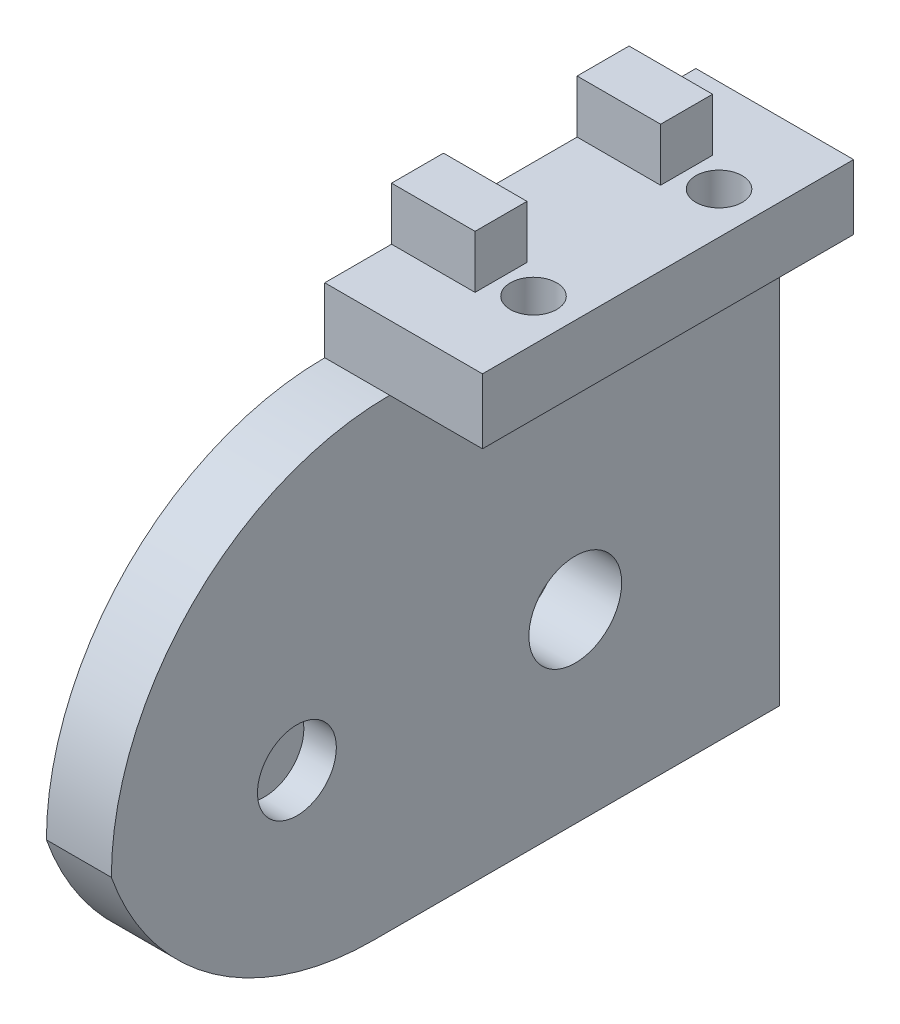
ISO-10303-21;
HEADER;
FILE_DESCRIPTION(('STEP AP214'),'2;1');
FILE_NAME('part.step','',(''),(''),'','','');
FILE_SCHEMA(('AUTOMOTIVE_DESIGN { 1 0 10303 214 1 1 1 1 }'));
ENDSEC;
DATA;
#1=APPLICATION_CONTEXT('core data for automotive mechanical design processes');
#2=APPLICATION_PROTOCOL_DEFINITION('international standard','automotive_design',2000,#1);
#3=PRODUCT_CONTEXT('',#1,'mechanical');
#4=PRODUCT('Part','Part','',(#3));
#5=PRODUCT_RELATED_PRODUCT_CATEGORY('part','',(#4));
#6=PRODUCT_DEFINITION_FORMATION('','',#4);
#7=PRODUCT_DEFINITION_CONTEXT('part definition',#1,'design');
#8=PRODUCT_DEFINITION('design','',#6,#7);
#9=PRODUCT_DEFINITION_SHAPE('','',#8);
#10=(LENGTH_UNIT() NAMED_UNIT(*) SI_UNIT(.MILLI.,.METRE.));
#11=(NAMED_UNIT(*) PLANE_ANGLE_UNIT() SI_UNIT($,.RADIAN.));
#12=(NAMED_UNIT(*) SI_UNIT($,.STERADIAN.) SOLID_ANGLE_UNIT());
#13=UNCERTAINTY_MEASURE_WITH_UNIT(LENGTH_MEASURE(1.E-05),#10,'distance_accuracy_value','');
#14=(GEOMETRIC_REPRESENTATION_CONTEXT(3) GLOBAL_UNCERTAINTY_ASSIGNED_CONTEXT((#13)) GLOBAL_UNIT_ASSIGNED_CONTEXT((#10,
#11,#12)) REPRESENTATION_CONTEXT('',''));
#15=CARTESIAN_POINT('',(0.,0.,0.));
#16=DIRECTION('',(0.,0.,1.));
#17=DIRECTION('',(1.,0.,0.));
#18=AXIS2_PLACEMENT_3D('',#15,#16,#17);
#19=CARTESIAN_POINT('',(20.,7.,20.));
#20=DIRECTION('',(0.,0.,-1.));
#21=DIRECTION('',(-1.,0.,0.));
#22=AXIS2_PLACEMENT_3D('',#19,#20,#21);
#23=PLANE('',#22);
#24=DIRECTION('',(1.,0.,0.));
#25=VECTOR('',#24,1.);
#26=CARTESIAN_POINT('',(20.,7.,20.));
#27=LINE('',#26,#25);
#28=CARTESIAN_POINT('',(3.,7.,20.));
#29=VERTEX_POINT('',#28);
#30=CARTESIAN_POINT('',(20.,7.,20.));
#31=VERTEX_POINT('',#30);
#32=EDGE_CURVE('E157',#29,#31,#27,.T.);
#33=ORIENTED_EDGE('',*,*,#32,.F.);
#34=DIRECTION('',(0.,-1.,0.));
#35=VECTOR('',#34,1.);
#36=CARTESIAN_POINT('',(3.,7.,20.));
#37=LINE('',#36,#35);
#38=CARTESIAN_POINT('',(3.,0.,20.));
#39=VERTEX_POINT('',#38);
#40=EDGE_CURVE('E151',#29,#39,#37,.T.);
#41=ORIENTED_EDGE('',*,*,#40,.T.);
#42=DIRECTION('',(1.,0.,0.));
#43=VECTOR('',#42,1.);
#44=CARTESIAN_POINT('',(20.,0.,20.));
#45=LINE('',#44,#43);
#46=CARTESIAN_POINT('',(10.,0.,20.));
#47=VERTEX_POINT('',#46);
#48=EDGE_CURVE('E154',#39,#47,#45,.T.);
#49=ORIENTED_EDGE('',*,*,#48,.T.);
#50=CARTESIAN_POINT('',(20.,0.,20.));
#51=VERTEX_POINT('',#50);
#52=EDGE_CURVE('E173',#47,#51,#45,.T.);
#53=ORIENTED_EDGE('',*,*,#52,.T.);
#54=DIRECTION('',(0.,-1.,0.));
#55=VECTOR('',#54,1.);
#56=CARTESIAN_POINT('',(20.,7.,20.));
#57=LINE('',#56,#55);
#58=EDGE_CURVE('E188',#31,#51,#57,.T.);
#59=ORIENTED_EDGE('',*,*,#58,.F.);
#60=EDGE_LOOP('',(#33,#41,#49,#53,#59));
#61=FACE_BOUND('',#60,.T.);
#62=ADVANCED_FACE('F34',(#61),#23,.F.);
#63=CARTESIAN_POINT('',(20.,7.,-20.));
#64=DIRECTION('',(-1.,0.,0.));
#65=DIRECTION('',(0.,0.,1.));
#66=AXIS2_PLACEMENT_3D('',#63,#64,#65);
#67=PLANE('',#66);
#68=DIRECTION('',(0.,-1.,0.));
#69=VECTOR('',#68,1.);
#70=CARTESIAN_POINT('',(20.,7.,-20.));
#71=LINE('',#70,#69);
#72=CARTESIAN_POINT('',(20.,7.,-20.));
#73=VERTEX_POINT('',#72);
#74=CARTESIAN_POINT('',(20.,0.,-20.));
#75=VERTEX_POINT('',#74);
#76=EDGE_CURVE('E185',#73,#75,#71,.T.);
#77=ORIENTED_EDGE('',*,*,#76,.F.);
#78=DIRECTION('',(0.,0.,-1.));
#79=VECTOR('',#78,1.);
#80=CARTESIAN_POINT('',(20.,7.,-20.));
#81=LINE('',#80,#79);
#82=EDGE_CURVE('E275',#31,#73,#81,.T.);
#83=ORIENTED_EDGE('',*,*,#82,.F.);
#84=ORIENTED_EDGE('',*,*,#58,.T.);
#85=DIRECTION('',(0.,0.,-1.));
#86=VECTOR('',#85,1.);
#87=CARTESIAN_POINT('',(20.,0.,-20.));
#88=LINE('',#87,#86);
#89=EDGE_CURVE('E172',#51,#75,#88,.T.);
#90=ORIENTED_EDGE('',*,*,#89,.T.);
#91=EDGE_LOOP('',(#77,#83,#84,#90));
#92=FACE_BOUND('',#91,.T.);
#93=ADVANCED_FACE('F338',(#92),#67,.F.);
#94=CARTESIAN_POINT('',(20.,7.,-20.));
#95=DIRECTION('',(0.,0.,1.));
#96=DIRECTION('',(1.,0.,0.));
#97=AXIS2_PLACEMENT_3D('',#94,#95,#96);
#98=PLANE('',#97);
#99=DIRECTION('',(-1.,0.,0.));
#100=VECTOR('',#99,1.);
#101=CARTESIAN_POINT('',(20.,0.,-20.));
#102=LINE('',#101,#100);
#103=CARTESIAN_POINT('',(10.,0.,-20.));
#104=VERTEX_POINT('',#103);
#105=CARTESIAN_POINT('',(3.,0.,-20.));
#106=VERTEX_POINT('',#105);
#107=EDGE_CURVE('E175',#104,#106,#102,.T.);
#108=ORIENTED_EDGE('',*,*,#107,.T.);
#109=DIRECTION('',(0.,1.,0.));
#110=VECTOR('',#109,1.);
#111=CARTESIAN_POINT('',(3.,7.,-20.));
#112=LINE('',#111,#110);
#113=CARTESIAN_POINT('',(3.,7.,-20.));
#114=VERTEX_POINT('',#113);
#115=EDGE_CURVE('E158',#106,#114,#112,.T.);
#116=ORIENTED_EDGE('',*,*,#115,.T.);
#117=DIRECTION('',(-1.,0.,0.));
#118=VECTOR('',#117,1.);
#119=CARTESIAN_POINT('',(20.,7.,-20.));
#120=LINE('',#119,#118);
#121=EDGE_CURVE('E179',#73,#114,#120,.T.);
#122=ORIENTED_EDGE('',*,*,#121,.F.);
#123=ORIENTED_EDGE('',*,*,#76,.T.);
#124=EDGE_CURVE('E182',#75,#104,#102,.T.);
#125=ORIENTED_EDGE('',*,*,#124,.T.);
#126=EDGE_LOOP('',(#108,#116,#122,#123,#125));
#127=FACE_BOUND('',#126,.T.);
#128=ADVANCED_FACE('F288',(#127),#98,.F.);
#129=CARTESIAN_POINT('',(0.,7.,0.));
#130=DIRECTION('',(0.,-1.,0.));
#131=DIRECTION('',(0.,0.,-1.));
#132=AXIS2_PLACEMENT_3D('',#129,#130,#131);
#133=PLANE('',#132);
#134=CARTESIAN_POINT('',(15.5,7.,10.));
#135=DIRECTION('',(0.,1.,0.));
#136=DIRECTION('',(0.,0.,1.));
#137=AXIS2_PLACEMENT_3D('',#134,#135,#136);
#138=CIRCLE('',#137,2.5);
#139=CARTESIAN_POINT('',(15.5,7.,12.5));
#140=VERTEX_POINT('',#139);
#141=EDGE_CURVE('E227',#140,#140,#138,.T.);
#142=ORIENTED_EDGE('',*,*,#141,.F.);
#143=EDGE_LOOP('',(#142));
#144=FACE_BOUND('',#143,.T.);
#145=CARTESIAN_POINT('',(15.5,7.,-10.));
#146=DIRECTION('',(0.,1.,0.));
#147=DIRECTION('',(0.,0.,1.));
#148=AXIS2_PLACEMENT_3D('',#145,#146,#147);
#149=CIRCLE('',#148,2.49999999999999);
#150=CARTESIAN_POINT('',(15.5,7.,-7.5));
#151=VERTEX_POINT('',#150);
#152=EDGE_CURVE('E228',#151,#151,#149,.T.);
#153=ORIENTED_EDGE('',*,*,#152,.F.);
#154=EDGE_LOOP('',(#153));
#155=FACE_BOUND('',#154,.T.);
#156=ORIENTED_EDGE('',*,*,#121,.T.);
#157=DIRECTION('',(0.,0.,1.));
#158=VECTOR('',#157,1.);
#159=CARTESIAN_POINT('',(3.,7.,0.));
#160=LINE('',#159,#158);
#161=CARTESIAN_POINT('',(3.,7.,-12.8));
#162=VERTEX_POINT('',#161);
#163=EDGE_CURVE('E284',#114,#162,#160,.T.);
#164=ORIENTED_EDGE('',*,*,#163,.T.);
#165=DIRECTION('',(-1.,0.,0.));
#166=VECTOR('',#165,1.);
#167=CARTESIAN_POINT('',(27.9906195003892,7.,-12.8));
#168=LINE('',#167,#166);
#169=CARTESIAN_POINT('',(12.,7.,-12.8));
#170=VERTEX_POINT('',#169);
#171=EDGE_CURVE('E267',#170,#162,#168,.T.);
#172=ORIENTED_EDGE('',*,*,#171,.F.);
#173=DIRECTION('',(0.,0.,1.));
#174=VECTOR('',#173,1.);
#175=CARTESIAN_POINT('',(12.,7.,-20.));
#176=LINE('',#175,#174);
#177=CARTESIAN_POINT('',(12.,7.,-7.20000000000001));
#178=VERTEX_POINT('',#177);
#179=EDGE_CURVE('E245',#170,#178,#176,.T.);
#180=ORIENTED_EDGE('',*,*,#179,.T.);
#181=DIRECTION('',(-1.,0.,0.));
#182=VECTOR('',#181,1.);
#183=CARTESIAN_POINT('',(27.9906195003892,7.,-7.20000000000001));
#184=LINE('',#183,#182);
#185=CARTESIAN_POINT('',(3.,7.,-7.20000000000001));
#186=VERTEX_POINT('',#185);
#187=EDGE_CURVE('E177',#178,#186,#184,.T.);
#188=ORIENTED_EDGE('',*,*,#187,.T.);
#189=CARTESIAN_POINT('',(3.,7.,7.2));
#190=VERTEX_POINT('',#189);
#191=EDGE_CURVE('E295',#186,#190,#160,.T.);
#192=ORIENTED_EDGE('',*,*,#191,.T.);
#193=DIRECTION('',(-1.,0.,0.));
#194=VECTOR('',#193,1.);
#195=CARTESIAN_POINT('',(27.9906195003892,7.,7.19999999999999));
#196=LINE('',#195,#194);
#197=CARTESIAN_POINT('',(12.,7.,7.19999999999999));
#198=VERTEX_POINT('',#197);
#199=EDGE_CURVE('E252',#198,#190,#196,.T.);
#200=ORIENTED_EDGE('',*,*,#199,.F.);
#201=CARTESIAN_POINT('',(12.,7.,12.8));
#202=VERTEX_POINT('',#201);
#203=EDGE_CURVE('E242',#198,#202,#176,.T.);
#204=ORIENTED_EDGE('',*,*,#203,.T.);
#205=DIRECTION('',(-1.,0.,0.));
#206=VECTOR('',#205,1.);
#207=CARTESIAN_POINT('',(27.9906195003892,7.,12.8));
#208=LINE('',#207,#206);
#209=CARTESIAN_POINT('',(3.,7.,12.8));
#210=VERTEX_POINT('',#209);
#211=EDGE_CURVE('E260',#202,#210,#208,.T.);
#212=ORIENTED_EDGE('',*,*,#211,.T.);
#213=EDGE_CURVE('E49',#210,#29,#160,.T.);
#214=ORIENTED_EDGE('',*,*,#213,.T.);
#215=ORIENTED_EDGE('',*,*,#32,.T.);
#216=ORIENTED_EDGE('',*,*,#82,.T.);
#217=EDGE_LOOP('',(#156,#164,#172,#180,#188,#192,#200,#204,#212,#214,#215,#216));
#218=FACE_BOUND('',#217,.T.);
#219=ADVANCED_FACE('F282',(#144,#155,#218),#133,.F.);
#220=CARTESIAN_POINT('',(0.,0.,0.));
#221=DIRECTION('',(0.,-1.,0.));
#222=DIRECTION('',(0.,0.,-1.));
#223=AXIS2_PLACEMENT_3D('',#220,#221,#222);
#224=PLANE('',#223);
#225=DIRECTION('',(0.,0.,1.));
#226=VECTOR('',#225,1.);
#227=CARTESIAN_POINT('',(9.99999999999999,0.,50.));
#228=LINE('',#227,#226);
#229=EDGE_CURVE('E193',#104,#47,#228,.T.);
#230=ORIENTED_EDGE('',*,*,#229,.F.);
#231=ORIENTED_EDGE('',*,*,#124,.F.);
#232=ORIENTED_EDGE('',*,*,#89,.F.);
#233=ORIENTED_EDGE('',*,*,#52,.F.);
#234=EDGE_LOOP('',(#230,#231,#232,#233));
#235=FACE_BOUND('',#234,.T.);
#236=CARTESIAN_POINT('',(15.5,0.,10.));
#237=DIRECTION('',(0.,-1.,0.));
#238=DIRECTION('',(0.,0.,-1.));
#239=AXIS2_PLACEMENT_3D('',#236,#237,#238);
#240=CIRCLE('',#239,2.5);
#241=CARTESIAN_POINT('',(15.5,0.,7.50000000000001));
#242=VERTEX_POINT('',#241);
#243=EDGE_CURVE('E232',#242,#242,#240,.F.);
#244=ORIENTED_EDGE('',*,*,#243,.T.);
#245=EDGE_LOOP('',(#244));
#246=FACE_BOUND('',#245,.T.);
#247=CARTESIAN_POINT('',(15.5,0.,-10.));
#248=DIRECTION('',(0.,-1.,0.));
#249=DIRECTION('',(0.,0.,-1.));
#250=AXIS2_PLACEMENT_3D('',#247,#248,#249);
#251=CIRCLE('',#250,2.49999999999999);
#252=CARTESIAN_POINT('',(15.5,0.,-12.5));
#253=VERTEX_POINT('',#252);
#254=EDGE_CURVE('E231',#253,#253,#251,.F.);
#255=ORIENTED_EDGE('',*,*,#254,.T.);
#256=EDGE_LOOP('',(#255));
#257=FACE_BOUND('',#256,.T.);
#258=ADVANCED_FACE('F374',(#235,#246,#257),#224,.T.);
#259=CARTESIAN_POINT('',(27.9906195003892,7.,-7.20000000000001));
#260=DIRECTION('',(0.,0.,1.));
#261=DIRECTION('',(1.,0.,0.));
#262=AXIS2_PLACEMENT_3D('',#259,#260,#261);
#263=PLANE('',#262);
#264=DIRECTION('',(0.,1.,0.));
#265=VECTOR('',#264,1.);
#266=CARTESIAN_POINT('',(3.,7.,-7.20000000000001));
#267=LINE('',#266,#265);
#268=CARTESIAN_POINT('',(3.,12.7,-7.2));
#269=VERTEX_POINT('',#268);
#270=EDGE_CURVE('E306',#186,#269,#267,.T.);
#271=ORIENTED_EDGE('',*,*,#270,.F.);
#272=ORIENTED_EDGE('',*,*,#187,.F.);
#273=DIRECTION('',(0.,-1.,0.));
#274=VECTOR('',#273,1.);
#275=CARTESIAN_POINT('',(12.,7.,-7.20000000000001));
#276=LINE('',#275,#274);
#277=CARTESIAN_POINT('',(12.,12.7,-7.2));
#278=VERTEX_POINT('',#277);
#279=EDGE_CURVE('E250',#278,#178,#276,.T.);
#280=ORIENTED_EDGE('',*,*,#279,.F.);
#281=DIRECTION('',(-1.,0.,0.));
#282=VECTOR('',#281,1.);
#283=CARTESIAN_POINT('',(27.9906195003892,12.7,-7.20000000000001));
#284=LINE('',#283,#282);
#285=EDGE_CURVE('E256',#278,#269,#284,.T.);
#286=ORIENTED_EDGE('',*,*,#285,.T.);
#287=EDGE_LOOP('',(#271,#272,#280,#286));
#288=FACE_BOUND('',#287,.T.);
#289=ADVANCED_FACE('F380',(#288),#263,.T.);
#290=CARTESIAN_POINT('',(27.9906195003892,7.,-12.8));
#291=DIRECTION('',(0.,0.,-1.));
#292=DIRECTION('',(0.,1.,0.));
#293=AXIS2_PLACEMENT_3D('',#290,#291,#292);
#294=PLANE('',#293);
#295=DIRECTION('',(0.,-1.,0.));
#296=VECTOR('',#295,1.);
#297=CARTESIAN_POINT('',(3.,7.,-12.8));
#298=LINE('',#297,#296);
#299=CARTESIAN_POINT('',(3.,12.7,-12.8));
#300=VERTEX_POINT('',#299);
#301=EDGE_CURVE('E302',#300,#162,#298,.T.);
#302=ORIENTED_EDGE('',*,*,#301,.F.);
#303=DIRECTION('',(-1.,0.,0.));
#304=VECTOR('',#303,1.);
#305=CARTESIAN_POINT('',(27.9906195003892,12.7,-12.8));
#306=LINE('',#305,#304);
#307=CARTESIAN_POINT('',(12.,12.7,-12.8));
#308=VERTEX_POINT('',#307);
#309=EDGE_CURVE('E270',#308,#300,#306,.T.);
#310=ORIENTED_EDGE('',*,*,#309,.F.);
#311=DIRECTION('',(0.,1.,0.));
#312=VECTOR('',#311,1.);
#313=CARTESIAN_POINT('',(12.,7.,-12.8));
#314=LINE('',#313,#312);
#315=EDGE_CURVE('E248',#170,#308,#314,.T.);
#316=ORIENTED_EDGE('',*,*,#315,.F.);
#317=ORIENTED_EDGE('',*,*,#171,.T.);
#318=EDGE_LOOP('',(#302,#310,#316,#317));
#319=FACE_BOUND('',#318,.T.);
#320=ADVANCED_FACE('F415',(#319),#294,.T.);
#321=CARTESIAN_POINT('',(27.9906195003892,12.7,-7.20000000000001));
#322=DIRECTION('',(0.,1.,0.));
#323=DIRECTION('',(0.,0.,1.));
#324=AXIS2_PLACEMENT_3D('',#321,#322,#323);
#325=PLANE('',#324);
#326=DIRECTION('',(0.,0.,-1.));
#327=VECTOR('',#326,1.);
#328=CARTESIAN_POINT('',(3.,12.7,-7.20000000000001));
#329=LINE('',#328,#327);
#330=EDGE_CURVE('E304',#269,#300,#329,.T.);
#331=ORIENTED_EDGE('',*,*,#330,.F.);
#332=ORIENTED_EDGE('',*,*,#285,.F.);
#333=DIRECTION('',(0.,0.,1.));
#334=VECTOR('',#333,1.);
#335=CARTESIAN_POINT('',(12.,12.7,-20.));
#336=LINE('',#335,#334);
#337=EDGE_CURVE('E241',#308,#278,#336,.T.);
#338=ORIENTED_EDGE('',*,*,#337,.F.);
#339=ORIENTED_EDGE('',*,*,#309,.T.);
#340=EDGE_LOOP('',(#331,#332,#338,#339));
#341=FACE_BOUND('',#340,.T.);
#342=ADVANCED_FACE('F413',(#341),#325,.T.);
#343=CARTESIAN_POINT('',(27.9906195003892,7.,7.19999999999999));
#344=DIRECTION('',(0.,0.,-1.));
#345=DIRECTION('',(-1.,0.,0.));
#346=AXIS2_PLACEMENT_3D('',#343,#344,#345);
#347=PLANE('',#346);
#348=DIRECTION('',(0.,-1.,0.));
#349=VECTOR('',#348,1.);
#350=CARTESIAN_POINT('',(3.,7.,7.2));
#351=LINE('',#350,#349);
#352=CARTESIAN_POINT('',(3.,12.7,7.19999999999999));
#353=VERTEX_POINT('',#352);
#354=EDGE_CURVE('E300',#353,#190,#351,.T.);
#355=ORIENTED_EDGE('',*,*,#354,.F.);
#356=DIRECTION('',(-1.,0.,0.));
#357=VECTOR('',#356,1.);
#358=CARTESIAN_POINT('',(27.9906195003892,12.7,7.19999999999999));
#359=LINE('',#358,#357);
#360=CARTESIAN_POINT('',(12.,12.7,7.19999999999999));
#361=VERTEX_POINT('',#360);
#362=EDGE_CURVE('E253',#361,#353,#359,.T.);
#363=ORIENTED_EDGE('',*,*,#362,.F.);
#364=DIRECTION('',(0.,1.,0.));
#365=VECTOR('',#364,1.);
#366=CARTESIAN_POINT('',(12.,7.,7.2));
#367=LINE('',#366,#365);
#368=EDGE_CURVE('E246',#198,#361,#367,.T.);
#369=ORIENTED_EDGE('',*,*,#368,.F.);
#370=ORIENTED_EDGE('',*,*,#199,.T.);
#371=EDGE_LOOP('',(#355,#363,#369,#370));
#372=FACE_BOUND('',#371,.T.);
#373=ADVANCED_FACE('F406',(#372),#347,.T.);
#374=CARTESIAN_POINT('',(27.9906195003892,12.7,7.19999999999999));
#375=DIRECTION('',(0.,1.,0.));
#376=DIRECTION('',(0.,0.,1.));
#377=AXIS2_PLACEMENT_3D('',#374,#375,#376);
#378=PLANE('',#377);
#379=DIRECTION('',(0.,0.,-1.));
#380=VECTOR('',#379,1.);
#381=CARTESIAN_POINT('',(3.,12.7,7.19999999999999));
#382=LINE('',#381,#380);
#383=CARTESIAN_POINT('',(3.,12.7,12.8));
#384=VERTEX_POINT('',#383);
#385=EDGE_CURVE('E298',#384,#353,#382,.T.);
#386=ORIENTED_EDGE('',*,*,#385,.F.);
#387=DIRECTION('',(-1.,0.,0.));
#388=VECTOR('',#387,1.);
#389=CARTESIAN_POINT('',(27.9906195003892,12.7,12.8));
#390=LINE('',#389,#388);
#391=CARTESIAN_POINT('',(12.,12.7,12.8));
#392=VERTEX_POINT('',#391);
#393=EDGE_CURVE('E257',#392,#384,#390,.T.);
#394=ORIENTED_EDGE('',*,*,#393,.F.);
#395=EDGE_CURVE('E235',#361,#392,#336,.T.);
#396=ORIENTED_EDGE('',*,*,#395,.F.);
#397=ORIENTED_EDGE('',*,*,#362,.T.);
#398=EDGE_LOOP('',(#386,#394,#396,#397));
#399=FACE_BOUND('',#398,.T.);
#400=ADVANCED_FACE('F403',(#399),#378,.T.);
#401=CARTESIAN_POINT('',(27.9906195003892,7.,12.8));
#402=DIRECTION('',(0.,0.,1.));
#403=DIRECTION('',(1.,0.,0.));
#404=AXIS2_PLACEMENT_3D('',#401,#402,#403);
#405=PLANE('',#404);
#406=DIRECTION('',(0.,1.,0.));
#407=VECTOR('',#406,1.);
#408=CARTESIAN_POINT('',(3.,7.,12.8));
#409=LINE('',#408,#407);
#410=EDGE_CURVE('E296',#210,#384,#409,.T.);
#411=ORIENTED_EDGE('',*,*,#410,.F.);
#412=ORIENTED_EDGE('',*,*,#211,.F.);
#413=DIRECTION('',(0.,-1.,0.));
#414=VECTOR('',#413,1.);
#415=CARTESIAN_POINT('',(12.,7.,12.8));
#416=LINE('',#415,#414);
#417=EDGE_CURVE('E191',#392,#202,#416,.T.);
#418=ORIENTED_EDGE('',*,*,#417,.F.);
#419=ORIENTED_EDGE('',*,*,#393,.T.);
#420=EDGE_LOOP('',(#411,#412,#418,#419));
#421=FACE_BOUND('',#420,.T.);
#422=ADVANCED_FACE('F401',(#421),#405,.T.);
#423=CARTESIAN_POINT('',(12.,-33.7921561087423,-20.));
#424=DIRECTION('',(-1.,0.,0.));
#425=DIRECTION('',(0.,0.,1.));
#426=AXIS2_PLACEMENT_3D('',#423,#424,#425);
#427=PLANE('',#426);
#428=ORIENTED_EDGE('',*,*,#368,.T.);
#429=ORIENTED_EDGE('',*,*,#395,.T.);
#430=ORIENTED_EDGE('',*,*,#417,.T.);
#431=ORIENTED_EDGE('',*,*,#203,.F.);
#432=EDGE_LOOP('',(#428,#429,#430,#431));
#433=FACE_BOUND('',#432,.T.);
#434=ADVANCED_FACE('F396',(#433),#427,.F.);
#435=ORIENTED_EDGE('',*,*,#279,.T.);
#436=ORIENTED_EDGE('',*,*,#179,.F.);
#437=ORIENTED_EDGE('',*,*,#315,.T.);
#438=ORIENTED_EDGE('',*,*,#337,.T.);
#439=EDGE_LOOP('',(#435,#436,#437,#438));
#440=FACE_BOUND('',#439,.T.);
#441=ADVANCED_FACE('F388',(#440),#427,.F.);
#442=CARTESIAN_POINT('',(15.5,-7.07106781186548,-10.));
#443=DIRECTION('',(0.,1.,0.));
#444=DIRECTION('',(0.,0.,1.));
#445=AXIS2_PLACEMENT_3D('',#442,#443,#444);
#446=CYLINDRICAL_SURFACE('',#445,2.49999999999999);
#447=ORIENTED_EDGE('',*,*,#152,.T.);
#448=EDGE_LOOP('',(#447));
#449=FACE_BOUND('',#448,.T.);
#450=ORIENTED_EDGE('',*,*,#254,.F.);
#451=EDGE_LOOP('',(#450));
#452=FACE_BOUND('',#451,.T.);
#453=ADVANCED_FACE('F386',(#449,#452),#446,.F.);
#454=CARTESIAN_POINT('',(15.5,-7.07106781186548,10.));
#455=DIRECTION('',(0.,1.,0.));
#456=DIRECTION('',(0.,0.,1.));
#457=AXIS2_PLACEMENT_3D('',#454,#455,#456);
#458=CYLINDRICAL_SURFACE('',#457,2.5);
#459=ORIENTED_EDGE('',*,*,#141,.T.);
#460=EDGE_LOOP('',(#459));
#461=FACE_BOUND('',#460,.T.);
#462=ORIENTED_EDGE('',*,*,#243,.F.);
#463=EDGE_LOOP('',(#462));
#464=FACE_BOUND('',#463,.T.);
#465=ADVANCED_FACE('F333',(#461,#464),#458,.F.);
#466=CARTESIAN_POINT('',(0.,0.,0.));
#467=DIRECTION('',(0.,1.,0.));
#468=DIRECTION('',(0.,0.,1.));
#469=AXIS2_PLACEMENT_3D('',#466,#467,#468);
#470=PLANE('',#469);
#471=ORIENTED_EDGE('',*,*,#107,.F.);
#472=CARTESIAN_POINT('',(10.,0.,-22.));
#473=VERTEX_POINT('',#472);
#474=EDGE_CURVE('E209',#473,#104,#228,.T.);
#475=ORIENTED_EDGE('',*,*,#474,.F.);
#476=DIRECTION('',(1.,0.,0.));
#477=VECTOR('',#476,1.);
#478=CARTESIAN_POINT('',(10.,0.,-22.));
#479=LINE('',#478,#477);
#480=CARTESIAN_POINT('',(3.,0.,-22.));
#481=VERTEX_POINT('',#480);
#482=EDGE_CURVE('E213',#481,#473,#479,.T.);
#483=ORIENTED_EDGE('',*,*,#482,.F.);
#484=DIRECTION('',(0.,0.,-1.));
#485=VECTOR('',#484,1.);
#486=CARTESIAN_POINT('',(2.99999999999999,0.,50.));
#487=LINE('',#486,#485);
#488=EDGE_CURVE('E221',#106,#481,#487,.T.);
#489=ORIENTED_EDGE('',*,*,#488,.F.);
#490=EDGE_LOOP('',(#471,#475,#483,#489));
#491=FACE_BOUND('',#490,.T.);
#492=ADVANCED_FACE('F324',(#491),#470,.T.);
#493=CARTESIAN_POINT('',(2.99999999999999,-50.,50.));
#494=DIRECTION('',(1.,0.,0.));
#495=DIRECTION('',(0.,0.,-1.));
#496=AXIS2_PLACEMENT_3D('',#493,#494,#495);
#497=PLANE('',#496);
#498=CARTESIAN_POINT('',(3.,-30.,0.));
#499=DIRECTION('',(1.,0.,0.));
#500=DIRECTION('',(0.,0.,-1.));
#501=AXIS2_PLACEMENT_3D('',#498,#499,#500);
#502=CIRCLE('',#501,5.);
#503=CARTESIAN_POINT('',(3.,-30.,-5.));
#504=VERTEX_POINT('',#503);
#505=EDGE_CURVE('E216',#504,#504,#502,.F.);
#506=ORIENTED_EDGE('',*,*,#505,.F.);
#507=EDGE_LOOP('',(#506));
#508=FACE_BOUND('',#507,.T.);
#509=DIRECTION('',(0.,0.,-1.));
#510=VECTOR('',#509,1.);
#511=CARTESIAN_POINT('',(2.99999999999999,-50.,50.));
#512=LINE('',#511,#510);
#513=CARTESIAN_POINT('',(3.,-50.,21.7157287525381));
#514=VERTEX_POINT('',#513);
#515=CARTESIAN_POINT('',(3.,-50.,-22.));
#516=VERTEX_POINT('',#515);
#517=EDGE_CURVE('E201',#514,#516,#512,.T.);
#518=ORIENTED_EDGE('',*,*,#517,.F.);
#519=CARTESIAN_POINT('',(3.,-20.,21.7157287525381));
#520=DIRECTION('',(1.,0.,0.));
#521=DIRECTION('',(0.,0.,-1.));
#522=AXIS2_PLACEMENT_3D('',#519,#520,#521);
#523=CIRCLE('',#522,30.);
#524=CARTESIAN_POINT('',(2.99999999999999,-30.,50.));
#525=VERTEX_POINT('',#524);
#526=EDGE_CURVE('E42',#514,#525,#523,.F.);
#527=ORIENTED_EDGE('',*,*,#526,.T.);
#528=CARTESIAN_POINT('',(3.,-30.,20.));
#529=DIRECTION('',(1.,0.,0.));
#530=DIRECTION('',(0.,0.,-1.));
#531=AXIS2_PLACEMENT_3D('',#528,#529,#530);
#532=CIRCLE('',#531,30.);
#533=EDGE_CURVE('E161',#525,#39,#532,.F.);
#534=ORIENTED_EDGE('',*,*,#533,.T.);
#535=ORIENTED_EDGE('',*,*,#40,.F.);
#536=ORIENTED_EDGE('',*,*,#213,.F.);
#537=ORIENTED_EDGE('',*,*,#410,.T.);
#538=ORIENTED_EDGE('',*,*,#385,.T.);
#539=ORIENTED_EDGE('',*,*,#354,.T.);
#540=ORIENTED_EDGE('',*,*,#191,.F.);
#541=ORIENTED_EDGE('',*,*,#270,.T.);
#542=ORIENTED_EDGE('',*,*,#330,.T.);
#543=ORIENTED_EDGE('',*,*,#301,.T.);
#544=ORIENTED_EDGE('',*,*,#163,.F.);
#545=ORIENTED_EDGE('',*,*,#115,.F.);
#546=ORIENTED_EDGE('',*,*,#488,.T.);
#547=DIRECTION('',(0.,1.,0.));
#548=VECTOR('',#547,1.);
#549=CARTESIAN_POINT('',(3.,-50.,-22.));
#550=LINE('',#549,#548);
#551=EDGE_CURVE('E207',#516,#481,#550,.T.);
#552=ORIENTED_EDGE('',*,*,#551,.F.);
#553=EDGE_LOOP('',(#518,#527,#534,#535,#536,#537,#538,#539,#540,#541,#542,#543,#544,#545,#546,#552));
#554=FACE_BOUND('',#553,.T.);
#555=ADVANCED_FACE('F163',(#508,#554),#497,.F.);
#556=CARTESIAN_POINT('',(10.,-50.,-22.));
#557=DIRECTION('',(0.,0.,1.));
#558=DIRECTION('',(1.,0.,0.));
#559=AXIS2_PLACEMENT_3D('',#556,#557,#558);
#560=PLANE('',#559);
#561=ORIENTED_EDGE('',*,*,#482,.T.);
#562=DIRECTION('',(0.,1.,0.));
#563=VECTOR('',#562,1.);
#564=CARTESIAN_POINT('',(10.,-50.,-22.));
#565=LINE('',#564,#563);
#566=CARTESIAN_POINT('',(10.,-50.,-22.));
#567=VERTEX_POINT('',#566);
#568=EDGE_CURVE('E220',#567,#473,#565,.T.);
#569=ORIENTED_EDGE('',*,*,#568,.F.);
#570=DIRECTION('',(1.,0.,0.));
#571=VECTOR('',#570,1.);
#572=CARTESIAN_POINT('',(10.,-50.,-22.));
#573=LINE('',#572,#571);
#574=EDGE_CURVE('E208',#516,#567,#573,.T.);
#575=ORIENTED_EDGE('',*,*,#574,.F.);
#576=ORIENTED_EDGE('',*,*,#551,.T.);
#577=EDGE_LOOP('',(#561,#569,#575,#576));
#578=FACE_BOUND('',#577,.T.);
#579=ADVANCED_FACE('F323',(#578),#560,.F.);
#580=CARTESIAN_POINT('',(9.99999999999999,-50.,50.));
#581=DIRECTION('',(-1.,0.,0.));
#582=DIRECTION('',(0.,0.,1.));
#583=AXIS2_PLACEMENT_3D('',#580,#581,#582);
#584=PLANE('',#583);
#585=CARTESIAN_POINT('',(10.,-30.,30.));
#586=DIRECTION('',(1.,0.,0.));
#587=DIRECTION('',(0.,0.,-1.));
#588=AXIS2_PLACEMENT_3D('',#585,#586,#587);
#589=CIRCLE('',#588,4.25);
#590=CARTESIAN_POINT('',(10.,-30.,25.75));
#591=VERTEX_POINT('',#590);
#592=EDGE_CURVE('E308',#591,#591,#589,.T.);
#593=ORIENTED_EDGE('',*,*,#592,.F.);
#594=EDGE_LOOP('',(#593));
#595=FACE_BOUND('',#594,.T.);
#596=CARTESIAN_POINT('',(10.,-30.,0.));
#597=DIRECTION('',(1.,0.,0.));
#598=DIRECTION('',(0.,0.,-1.));
#599=AXIS2_PLACEMENT_3D('',#596,#597,#598);
#600=CIRCLE('',#599,5.);
#601=CARTESIAN_POINT('',(10.,-30.,-5.));
#602=VERTEX_POINT('',#601);
#603=EDGE_CURVE('E312',#602,#602,#600,.T.);
#604=ORIENTED_EDGE('',*,*,#603,.F.);
#605=EDGE_LOOP('',(#604));
#606=FACE_BOUND('',#605,.T.);
#607=CARTESIAN_POINT('',(10.,-30.,20.));
#608=DIRECTION('',(-1.,0.,0.));
#609=DIRECTION('',(0.,0.,1.));
#610=AXIS2_PLACEMENT_3D('',#607,#608,#609);
#611=CIRCLE('',#610,30.);
#612=CARTESIAN_POINT('',(9.99999999999999,-30.,50.));
#613=VERTEX_POINT('',#612);
#614=EDGE_CURVE('E167',#47,#613,#611,.F.);
#615=ORIENTED_EDGE('',*,*,#614,.T.);
#616=CARTESIAN_POINT('',(10.,-20.,21.7157287525381));
#617=DIRECTION('',(-1.,0.,0.));
#618=DIRECTION('',(0.,0.,1.));
#619=AXIS2_PLACEMENT_3D('',#616,#617,#618);
#620=CIRCLE('',#619,30.);
#621=CARTESIAN_POINT('',(10.,-50.,21.7157287525381));
#622=VERTEX_POINT('',#621);
#623=EDGE_CURVE('E11',#613,#622,#620,.F.);
#624=ORIENTED_EDGE('',*,*,#623,.T.);
#625=DIRECTION('',(0.,0.,1.));
#626=VECTOR('',#625,1.);
#627=CARTESIAN_POINT('',(9.99999999999999,-50.,50.));
#628=LINE('',#627,#626);
#629=EDGE_CURVE('E203',#567,#622,#628,.T.);
#630=ORIENTED_EDGE('',*,*,#629,.F.);
#631=ORIENTED_EDGE('',*,*,#568,.T.);
#632=ORIENTED_EDGE('',*,*,#474,.T.);
#633=ORIENTED_EDGE('',*,*,#229,.T.);
#634=EDGE_LOOP('',(#615,#624,#630,#631,#632,#633));
#635=FACE_BOUND('',#634,.T.);
#636=ADVANCED_FACE('F330',(#595,#606,#635),#584,.F.);
#637=CARTESIAN_POINT('',(0.,-50.,0.));
#638=DIRECTION('',(0.,1.,0.));
#639=DIRECTION('',(0.,0.,1.));
#640=AXIS2_PLACEMENT_3D('',#637,#638,#639);
#641=PLANE('',#640);
#642=ORIENTED_EDGE('',*,*,#629,.T.);
#643=DIRECTION('',(-1.,0.,0.));
#644=VECTOR('',#643,1.);
#645=CARTESIAN_POINT('',(0.,-50.,21.7157287525381));
#646=LINE('',#645,#644);
#647=EDGE_CURVE('E196',#622,#514,#646,.T.);
#648=ORIENTED_EDGE('',*,*,#647,.T.);
#649=ORIENTED_EDGE('',*,*,#517,.T.);
#650=ORIENTED_EDGE('',*,*,#574,.T.);
#651=EDGE_LOOP('',(#642,#648,#649,#650));
#652=FACE_BOUND('',#651,.T.);
#653=ADVANCED_FACE('F200',(#652),#641,.F.);
#654=CARTESIAN_POINT('',(-11.142135623731,-30.,0.));
#655=DIRECTION('',(1.,0.,0.));
#656=DIRECTION('',(0.,0.,-1.));
#657=AXIS2_PLACEMENT_3D('',#654,#655,#656);
#658=CYLINDRICAL_SURFACE('',#657,5.);
#659=ORIENTED_EDGE('',*,*,#505,.T.);
#660=EDGE_LOOP('',(#659));
#661=FACE_BOUND('',#660,.T.);
#662=ORIENTED_EDGE('',*,*,#603,.T.);
#663=EDGE_LOOP('',(#662));
#664=FACE_BOUND('',#663,.T.);
#665=ADVANCED_FACE('F320',(#661,#664),#658,.F.);
#666=CARTESIAN_POINT('',(6.5,-30.,30.));
#667=DIRECTION('',(1.,0.,0.));
#668=DIRECTION('',(0.,0.,-1.));
#669=AXIS2_PLACEMENT_3D('',#666,#667,#668);
#670=CYLINDRICAL_SURFACE('',#669,4.25);
#671=CARTESIAN_POINT('',(6.5,-30.,30.));
#672=DIRECTION('',(1.,0.,0.));
#673=DIRECTION('',(0.,0.,-1.));
#674=AXIS2_PLACEMENT_3D('',#671,#672,#673);
#675=CIRCLE('',#674,4.25);
#676=CARTESIAN_POINT('',(6.5,-30.,25.75));
#677=VERTEX_POINT('',#676);
#678=EDGE_CURVE('E309',#677,#677,#675,.T.);
#679=ORIENTED_EDGE('',*,*,#678,.F.);
#680=EDGE_LOOP('',(#679));
#681=FACE_BOUND('',#680,.T.);
#682=ORIENTED_EDGE('',*,*,#592,.T.);
#683=EDGE_LOOP('',(#682));
#684=FACE_BOUND('',#683,.T.);
#685=ADVANCED_FACE('F352',(#681,#684),#670,.F.);
#686=CARTESIAN_POINT('',(6.5,-30.,30.));
#687=DIRECTION('',(1.,0.,0.));
#688=DIRECTION('',(0.,0.,-1.));
#689=AXIS2_PLACEMENT_3D('',#686,#687,#688);
#690=PLANE('',#689);
#691=ORIENTED_EDGE('',*,*,#678,.T.);
#692=EDGE_LOOP('',(#691));
#693=FACE_BOUND('',#692,.T.);
#694=ADVANCED_FACE('F347',(#693),#690,.T.);
#695=CARTESIAN_POINT('',(9.99999999999997,-30.,20.));
#696=DIRECTION('',(1.,0.,0.));
#697=DIRECTION('',(0.,0.,-1.));
#698=AXIS2_PLACEMENT_3D('',#695,#696,#697);
#699=CYLINDRICAL_SURFACE('',#698,30.);
#700=ORIENTED_EDGE('',*,*,#614,.F.);
#701=ORIENTED_EDGE('',*,*,#48,.F.);
#702=ORIENTED_EDGE('',*,*,#533,.F.);
#703=DIRECTION('',(-1.,0.,0.));
#704=VECTOR('',#703,1.);
#705=CARTESIAN_POINT('',(3.,-30.,50.));
#706=LINE('',#705,#704);
#707=EDGE_CURVE('E168',#613,#525,#706,.T.);
#708=ORIENTED_EDGE('',*,*,#707,.F.);
#709=EDGE_LOOP('',(#700,#701,#702,#708));
#710=FACE_BOUND('',#709,.T.);
#711=ADVANCED_FACE('F171',(#710),#699,.T.);
#712=CARTESIAN_POINT('',(9.99999999999997,-20.,21.7157287525381));
#713=DIRECTION('',(-1.,0.,0.));
#714=DIRECTION('',(0.,0.,1.));
#715=AXIS2_PLACEMENT_3D('',#712,#713,#714);
#716=CYLINDRICAL_SURFACE('',#715,30.);
#717=ORIENTED_EDGE('',*,*,#623,.F.);
#718=ORIENTED_EDGE('',*,*,#707,.T.);
#719=ORIENTED_EDGE('',*,*,#526,.F.);
#720=ORIENTED_EDGE('',*,*,#647,.F.);
#721=EDGE_LOOP('',(#717,#718,#719,#720));
#722=FACE_BOUND('',#721,.T.);
#723=ADVANCED_FACE('F36',(#722),#716,.T.);
#724=CLOSED_SHELL('',(#62,#93,#128,#219,#258,#289,#320,#342,#373,#400,#422,#434,#441,#453,#465,
#492,#555,#579,#636,#653,#665,#685,#694,#711,#723));
#725=MANIFOLD_SOLID_BREP('B2',#724);
#726=ADVANCED_BREP_SHAPE_REPRESENTATION('',(#18,#725),#14);
#727=SHAPE_DEFINITION_REPRESENTATION(#9,#726);
ENDSEC;
END-ISO-10303-21;
